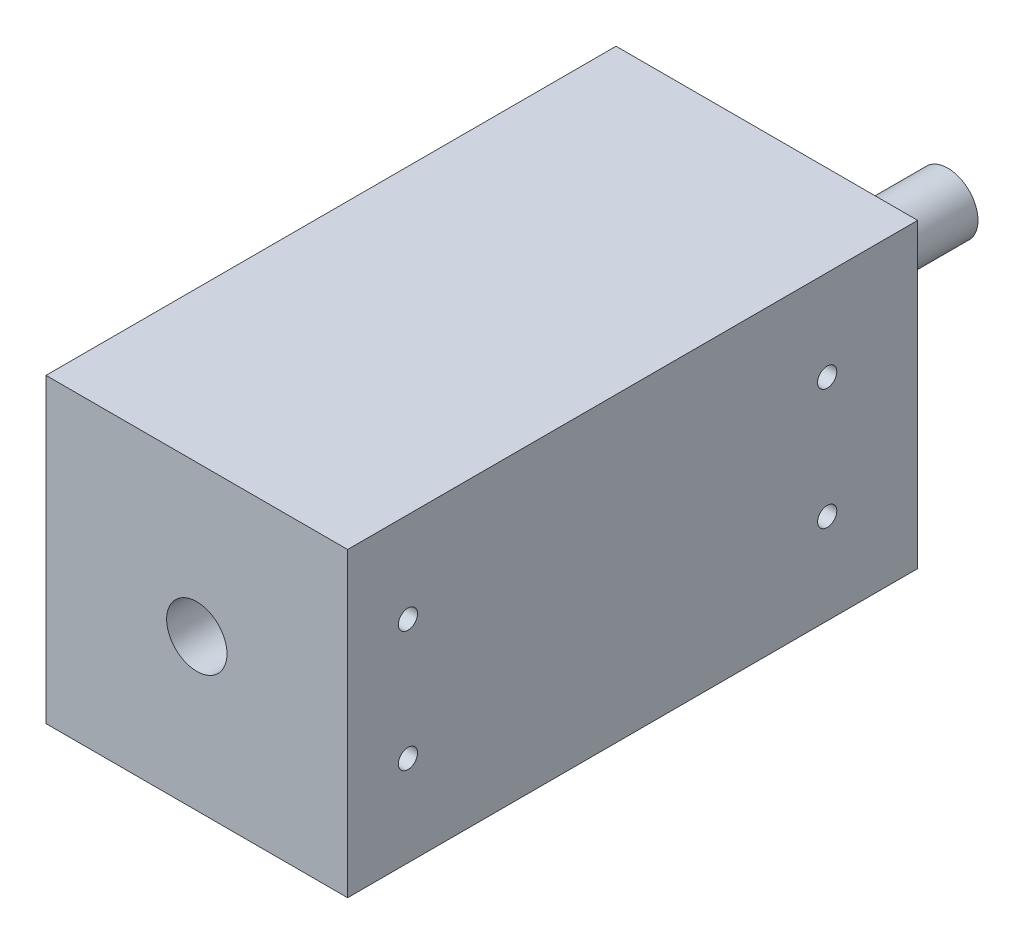
ISO-10303-21;
HEADER;
FILE_DESCRIPTION(('STEP AP214'),'2;1');
FILE_NAME('part.step','',(''),(''),'','','');
FILE_SCHEMA(('AUTOMOTIVE_DESIGN { 1 0 10303 214 1 1 1 1 }'));
ENDSEC;
DATA;
#1=APPLICATION_CONTEXT('core data for automotive mechanical design processes');
#2=APPLICATION_PROTOCOL_DEFINITION('international standard','automotive_design',2000,#1);
#3=PRODUCT_CONTEXT('',#1,'mechanical');
#4=PRODUCT('Part','Part','',(#3));
#5=PRODUCT_RELATED_PRODUCT_CATEGORY('part','',(#4));
#6=PRODUCT_DEFINITION_FORMATION('','',#4);
#7=PRODUCT_DEFINITION_CONTEXT('part definition',#1,'design');
#8=PRODUCT_DEFINITION('design','',#6,#7);
#9=PRODUCT_DEFINITION_SHAPE('','',#8);
#10=(LENGTH_UNIT() NAMED_UNIT(*) SI_UNIT(.MILLI.,.METRE.));
#11=(NAMED_UNIT(*) PLANE_ANGLE_UNIT() SI_UNIT($,.RADIAN.));
#12=(NAMED_UNIT(*) SI_UNIT($,.STERADIAN.) SOLID_ANGLE_UNIT());
#13=UNCERTAINTY_MEASURE_WITH_UNIT(LENGTH_MEASURE(1.E-05),#10,'distance_accuracy_value','');
#14=(GEOMETRIC_REPRESENTATION_CONTEXT(3) GLOBAL_UNCERTAINTY_ASSIGNED_CONTEXT((#13)) GLOBAL_UNIT_ASSIGNED_CONTEXT((#10,
#11,#12)) REPRESENTATION_CONTEXT('',''));
#15=CARTESIAN_POINT('',(0.,0.,0.));
#16=DIRECTION('',(0.,0.,1.));
#17=DIRECTION('',(1.,0.,0.));
#18=AXIS2_PLACEMENT_3D('',#15,#16,#17);
#19=CARTESIAN_POINT('',(31.75,31.75,60.0075));
#20=DIRECTION('',(-1.,0.,0.));
#21=DIRECTION('',(0.,-1.,0.));
#22=AXIS2_PLACEMENT_3D('',#19,#20,#21);
#23=PLANE('',#22);
#24=CARTESIAN_POINT('',(31.75,12.7,-40.9575));
#25=DIRECTION('',(-1.,0.,0.));
#26=DIRECTION('',(0.,0.,1.));
#27=AXIS2_PLACEMENT_3D('',#24,#25,#26);
#28=CIRCLE('',#27,2.01929999999999);
#29=CARTESIAN_POINT('',(31.75,12.7,-38.9382));
#30=VERTEX_POINT('',#29);
#31=EDGE_CURVE('E139',#30,#30,#28,.T.);
#32=ORIENTED_EDGE('',*,*,#31,.T.);
#33=EDGE_LOOP('',(#32));
#34=FACE_BOUND('',#33,.T.);
#35=CARTESIAN_POINT('',(31.75,-12.7,-40.9575));
#36=DIRECTION('',(-1.,0.,0.));
#37=DIRECTION('',(0.,0.,1.));
#38=AXIS2_PLACEMENT_3D('',#35,#36,#37);
#39=CIRCLE('',#38,2.01929999999999);
#40=CARTESIAN_POINT('',(31.75,-12.7,-38.9382));
#41=VERTEX_POINT('',#40);
#42=EDGE_CURVE('E143',#41,#41,#39,.T.);
#43=ORIENTED_EDGE('',*,*,#42,.T.);
#44=EDGE_LOOP('',(#43));
#45=FACE_BOUND('',#44,.T.);
#46=CARTESIAN_POINT('',(31.75,-12.7,47.3075));
#47=DIRECTION('',(-1.,0.,0.));
#48=DIRECTION('',(0.,0.,1.));
#49=AXIS2_PLACEMENT_3D('',#46,#47,#48);
#50=CIRCLE('',#49,2.01929999999999);
#51=CARTESIAN_POINT('',(31.75,-12.7,49.3268));
#52=VERTEX_POINT('',#51);
#53=EDGE_CURVE('E147',#52,#52,#50,.T.);
#54=ORIENTED_EDGE('',*,*,#53,.T.);
#55=EDGE_LOOP('',(#54));
#56=FACE_BOUND('',#55,.T.);
#57=CARTESIAN_POINT('',(31.75,12.7,47.3075));
#58=DIRECTION('',(-1.,0.,0.));
#59=DIRECTION('',(0.,0.,1.));
#60=AXIS2_PLACEMENT_3D('',#57,#58,#59);
#61=CIRCLE('',#60,2.01929999999999);
#62=CARTESIAN_POINT('',(31.75,12.7,49.3268));
#63=VERTEX_POINT('',#62);
#64=EDGE_CURVE('E150',#63,#63,#61,.T.);
#65=ORIENTED_EDGE('',*,*,#64,.T.);
#66=EDGE_LOOP('',(#65));
#67=FACE_BOUND('',#66,.T.);
#68=DIRECTION('',(0.,1.,0.));
#69=VECTOR('',#68,1.);
#70=CARTESIAN_POINT('',(31.75,31.75,-60.0075));
#71=LINE('',#70,#69);
#72=CARTESIAN_POINT('',(31.75,-31.75,-60.0075));
#73=VERTEX_POINT('',#72);
#74=CARTESIAN_POINT('',(31.75,31.75,-60.0075));
#75=VERTEX_POINT('',#74);
#76=EDGE_CURVE('E101',#73,#75,#71,.T.);
#77=ORIENTED_EDGE('',*,*,#76,.T.);
#78=DIRECTION('',(0.,0.,-1.));
#79=VECTOR('',#78,1.);
#80=CARTESIAN_POINT('',(31.75,31.75,60.0075));
#81=LINE('',#80,#79);
#82=CARTESIAN_POINT('',(31.75,31.75,60.0075));
#83=VERTEX_POINT('',#82);
#84=EDGE_CURVE('E43',#83,#75,#81,.T.);
#85=ORIENTED_EDGE('',*,*,#84,.F.);
#86=DIRECTION('',(0.,1.,0.));
#87=VECTOR('',#86,1.);
#88=CARTESIAN_POINT('',(31.75,31.75,60.0075));
#89=LINE('',#88,#87);
#90=CARTESIAN_POINT('',(31.75,-31.75,60.0075));
#91=VERTEX_POINT('',#90);
#92=EDGE_CURVE('E87',#91,#83,#89,.T.);
#93=ORIENTED_EDGE('',*,*,#92,.F.);
#94=DIRECTION('',(0.,0.,-1.));
#95=VECTOR('',#94,1.);
#96=CARTESIAN_POINT('',(31.75,-31.75,60.0075));
#97=LINE('',#96,#95);
#98=EDGE_CURVE('E97',#91,#73,#97,.T.);
#99=ORIENTED_EDGE('',*,*,#98,.T.);
#100=EDGE_LOOP('',(#77,#85,#93,#99));
#101=FACE_BOUND('',#100,.T.);
#102=ADVANCED_FACE('F35',(#34,#45,#56,#67,#101),#23,.F.);
#103=CARTESIAN_POINT('',(-31.75,31.75,60.0075));
#104=DIRECTION('',(0.,-1.,0.));
#105=DIRECTION('',(0.,0.,-1.));
#106=AXIS2_PLACEMENT_3D('',#103,#104,#105);
#107=PLANE('',#106);
#108=DIRECTION('',(-1.,0.,0.));
#109=VECTOR('',#108,1.);
#110=CARTESIAN_POINT('',(-31.75,31.75,-60.0075));
#111=LINE('',#110,#109);
#112=CARTESIAN_POINT('',(-31.75,31.75,-60.0075));
#113=VERTEX_POINT('',#112);
#114=EDGE_CURVE('E92',#75,#113,#111,.T.);
#115=ORIENTED_EDGE('',*,*,#114,.T.);
#116=DIRECTION('',(0.,0.,-1.));
#117=VECTOR('',#116,1.);
#118=CARTESIAN_POINT('',(-31.75,31.75,60.0075));
#119=LINE('',#118,#117);
#120=CARTESIAN_POINT('',(-31.75,31.75,60.0075));
#121=VERTEX_POINT('',#120);
#122=EDGE_CURVE('E90',#121,#113,#119,.T.);
#123=ORIENTED_EDGE('',*,*,#122,.F.);
#124=DIRECTION('',(-1.,0.,0.));
#125=VECTOR('',#124,1.);
#126=CARTESIAN_POINT('',(-31.75,31.75,60.0075));
#127=LINE('',#126,#125);
#128=EDGE_CURVE('E82',#83,#121,#127,.T.);
#129=ORIENTED_EDGE('',*,*,#128,.F.);
#130=ORIENTED_EDGE('',*,*,#84,.T.);
#131=EDGE_LOOP('',(#115,#123,#129,#130));
#132=FACE_BOUND('',#131,.T.);
#133=ADVANCED_FACE('F91',(#132),#107,.F.);
#134=CARTESIAN_POINT('',(-31.75,31.75,60.0075));
#135=DIRECTION('',(1.,0.,0.));
#136=DIRECTION('',(0.,1.,0.));
#137=AXIS2_PLACEMENT_3D('',#134,#135,#136);
#138=PLANE('',#137);
#139=CARTESIAN_POINT('',(-31.75,12.7,-40.9575));
#140=DIRECTION('',(-1.,0.,0.));
#141=DIRECTION('',(0.,0.,1.));
#142=AXIS2_PLACEMENT_3D('',#139,#140,#141);
#143=CIRCLE('',#142,2.0193);
#144=CARTESIAN_POINT('',(-31.75,12.7,-38.9382));
#145=VERTEX_POINT('',#144);
#146=EDGE_CURVE('E200',#145,#145,#143,.T.);
#147=ORIENTED_EDGE('',*,*,#146,.F.);
#148=EDGE_LOOP('',(#147));
#149=FACE_BOUND('',#148,.T.);
#150=CARTESIAN_POINT('',(-31.75,-12.7,-40.9575));
#151=DIRECTION('',(-1.,0.,0.));
#152=DIRECTION('',(0.,0.,1.));
#153=AXIS2_PLACEMENT_3D('',#150,#151,#152);
#154=CIRCLE('',#153,2.0193);
#155=CARTESIAN_POINT('',(-31.75,-12.7,-38.9382));
#156=VERTEX_POINT('',#155);
#157=EDGE_CURVE('E203',#156,#156,#154,.T.);
#158=ORIENTED_EDGE('',*,*,#157,.F.);
#159=EDGE_LOOP('',(#158));
#160=FACE_BOUND('',#159,.T.);
#161=CARTESIAN_POINT('',(-31.75,-12.7,47.3075));
#162=DIRECTION('',(-1.,0.,0.));
#163=DIRECTION('',(0.,0.,1.));
#164=AXIS2_PLACEMENT_3D('',#161,#162,#163);
#165=CIRCLE('',#164,2.0193);
#166=CARTESIAN_POINT('',(-31.75,-12.7,49.3268));
#167=VERTEX_POINT('',#166);
#168=EDGE_CURVE('E209',#167,#167,#165,.T.);
#169=ORIENTED_EDGE('',*,*,#168,.F.);
#170=EDGE_LOOP('',(#169));
#171=FACE_BOUND('',#170,.T.);
#172=CARTESIAN_POINT('',(-31.75,12.7,47.3075));
#173=DIRECTION('',(-1.,0.,0.));
#174=DIRECTION('',(0.,0.,1.));
#175=AXIS2_PLACEMENT_3D('',#172,#173,#174);
#176=CIRCLE('',#175,2.0193);
#177=CARTESIAN_POINT('',(-31.75,12.7,49.3268));
#178=VERTEX_POINT('',#177);
#179=EDGE_CURVE('E153',#178,#178,#176,.T.);
#180=ORIENTED_EDGE('',*,*,#179,.F.);
#181=EDGE_LOOP('',(#180));
#182=FACE_BOUND('',#181,.T.);
#183=DIRECTION('',(0.,-1.,0.));
#184=VECTOR('',#183,1.);
#185=CARTESIAN_POINT('',(-31.75,31.75,-60.0075));
#186=LINE('',#185,#184);
#187=CARTESIAN_POINT('',(-31.75,-31.75,-60.0075));
#188=VERTEX_POINT('',#187);
#189=EDGE_CURVE('E68',#113,#188,#186,.T.);
#190=ORIENTED_EDGE('',*,*,#189,.T.);
#191=DIRECTION('',(0.,0.,-1.));
#192=VECTOR('',#191,1.);
#193=CARTESIAN_POINT('',(-31.75,-31.75,60.0075));
#194=LINE('',#193,#192);
#195=CARTESIAN_POINT('',(-31.75,-31.75,60.0075));
#196=VERTEX_POINT('',#195);
#197=EDGE_CURVE('E93',#196,#188,#194,.T.);
#198=ORIENTED_EDGE('',*,*,#197,.F.);
#199=DIRECTION('',(0.,-1.,0.));
#200=VECTOR('',#199,1.);
#201=CARTESIAN_POINT('',(-31.75,31.75,60.0075));
#202=LINE('',#201,#200);
#203=EDGE_CURVE('E85',#121,#196,#202,.T.);
#204=ORIENTED_EDGE('',*,*,#203,.F.);
#205=ORIENTED_EDGE('',*,*,#122,.T.);
#206=EDGE_LOOP('',(#190,#198,#204,#205));
#207=FACE_BOUND('',#206,.T.);
#208=ADVANCED_FACE('F95',(#149,#160,#171,#182,#207),#138,.F.);
#209=CARTESIAN_POINT('',(-31.75,-31.75,60.0075));
#210=DIRECTION('',(0.,1.,0.));
#211=DIRECTION('',(0.,0.,1.));
#212=AXIS2_PLACEMENT_3D('',#209,#210,#211);
#213=PLANE('',#212);
#214=DIRECTION('',(1.,0.,0.));
#215=VECTOR('',#214,1.);
#216=CARTESIAN_POINT('',(-31.75,-31.75,-60.0075));
#217=LINE('',#216,#215);
#218=EDGE_CURVE('E74',#188,#73,#217,.T.);
#219=ORIENTED_EDGE('',*,*,#218,.T.);
#220=ORIENTED_EDGE('',*,*,#98,.F.);
#221=DIRECTION('',(1.,0.,0.));
#222=VECTOR('',#221,1.);
#223=CARTESIAN_POINT('',(-31.75,-31.75,60.0075));
#224=LINE('',#223,#222);
#225=EDGE_CURVE('E51',#196,#91,#224,.T.);
#226=ORIENTED_EDGE('',*,*,#225,.F.);
#227=ORIENTED_EDGE('',*,*,#197,.T.);
#228=EDGE_LOOP('',(#219,#220,#226,#227));
#229=FACE_BOUND('',#228,.T.);
#230=ADVANCED_FACE('F124',(#229),#213,.F.);
#231=CARTESIAN_POINT('',(0.,0.,60.0075));
#232=DIRECTION('',(0.,0.,1.));
#233=DIRECTION('',(1.,0.,0.));
#234=AXIS2_PLACEMENT_3D('',#231,#232,#233);
#235=PLANE('',#234);
#236=CARTESIAN_POINT('',(0.,0.,60.0075));
#237=DIRECTION('',(0.,0.,1.));
#238=DIRECTION('',(1.,0.,0.));
#239=AXIS2_PLACEMENT_3D('',#236,#237,#238);
#240=CIRCLE('',#239,6.35);
#241=CARTESIAN_POINT('',(6.35,0.,60.0075));
#242=VERTEX_POINT('',#241);
#243=EDGE_CURVE('E152',#242,#242,#240,.T.);
#244=ORIENTED_EDGE('',*,*,#243,.F.);
#245=EDGE_LOOP('',(#244));
#246=FACE_BOUND('',#245,.T.);
#247=ORIENTED_EDGE('',*,*,#92,.T.);
#248=ORIENTED_EDGE('',*,*,#128,.T.);
#249=ORIENTED_EDGE('',*,*,#203,.T.);
#250=ORIENTED_EDGE('',*,*,#225,.T.);
#251=EDGE_LOOP('',(#247,#248,#249,#250));
#252=FACE_BOUND('',#251,.T.);
#253=ADVANCED_FACE('F83',(#246,#252),#235,.T.);
#254=CARTESIAN_POINT('',(0.,0.,-60.0075));
#255=DIRECTION('',(0.,0.,1.));
#256=DIRECTION('',(1.,0.,0.));
#257=AXIS2_PLACEMENT_3D('',#254,#255,#256);
#258=PLANE('',#257);
#259=CARTESIAN_POINT('',(0.,0.,-60.0075));
#260=DIRECTION('',(0.,0.,1.));
#261=DIRECTION('',(1.,0.,0.));
#262=AXIS2_PLACEMENT_3D('',#259,#260,#261);
#263=CIRCLE('',#262,6.35);
#264=CARTESIAN_POINT('',(6.35,0.,-60.0075));
#265=VERTEX_POINT('',#264);
#266=EDGE_CURVE('E11',#265,#265,#263,.F.);
#267=ORIENTED_EDGE('',*,*,#266,.F.);
#268=EDGE_LOOP('',(#267));
#269=FACE_BOUND('',#268,.T.);
#270=ORIENTED_EDGE('',*,*,#76,.F.);
#271=ORIENTED_EDGE('',*,*,#218,.F.);
#272=ORIENTED_EDGE('',*,*,#189,.F.);
#273=ORIENTED_EDGE('',*,*,#114,.F.);
#274=EDGE_LOOP('',(#270,#271,#272,#273));
#275=FACE_BOUND('',#274,.T.);
#276=ADVANCED_FACE('F112',(#269,#275),#258,.F.);
#277=CARTESIAN_POINT('',(0.,0.,-98.1075));
#278=DIRECTION('',(0.,0.,1.));
#279=DIRECTION('',(1.,0.,0.));
#280=AXIS2_PLACEMENT_3D('',#277,#278,#279);
#281=CYLINDRICAL_SURFACE('',#280,6.35);
#282=CARTESIAN_POINT('',(0.,0.,-98.1075));
#283=DIRECTION('',(0.,0.,-1.));
#284=DIRECTION('',(-1.,0.,0.));
#285=AXIS2_PLACEMENT_3D('',#282,#283,#284);
#286=CIRCLE('',#285,6.35);
#287=CARTESIAN_POINT('',(-6.35,0.,-98.1075));
#288=VERTEX_POINT('',#287);
#289=EDGE_CURVE('E104',#288,#288,#286,.T.);
#290=ORIENTED_EDGE('',*,*,#289,.F.);
#291=EDGE_LOOP('',(#290));
#292=FACE_BOUND('',#291,.T.);
#293=ORIENTED_EDGE('',*,*,#266,.T.);
#294=EDGE_LOOP('',(#293));
#295=FACE_BOUND('',#294,.T.);
#296=ADVANCED_FACE('F114',(#292,#295),#281,.T.);
#297=CARTESIAN_POINT('',(0.,0.,-98.1075));
#298=DIRECTION('',(0.,0.,-1.));
#299=DIRECTION('',(-1.,0.,0.));
#300=AXIS2_PLACEMENT_3D('',#297,#298,#299);
#301=PLANE('',#300);
#302=ORIENTED_EDGE('',*,*,#289,.T.);
#303=EDGE_LOOP('',(#302));
#304=FACE_BOUND('',#303,.T.);
#305=ADVANCED_FACE('F121',(#304),#301,.T.);
#306=CARTESIAN_POINT('',(0.,0.,21.9075));
#307=DIRECTION('',(0.,0.,1.));
#308=DIRECTION('',(1.,0.,0.));
#309=AXIS2_PLACEMENT_3D('',#306,#307,#308);
#310=CYLINDRICAL_SURFACE('',#309,6.35);
#311=CARTESIAN_POINT('',(0.,0.,21.9075));
#312=DIRECTION('',(0.,0.,1.));
#313=DIRECTION('',(1.,0.,0.));
#314=AXIS2_PLACEMENT_3D('',#311,#312,#313);
#315=CIRCLE('',#314,6.35);
#316=CARTESIAN_POINT('',(6.35,0.,21.9075));
#317=VERTEX_POINT('',#316);
#318=EDGE_CURVE('E156',#317,#317,#315,.T.);
#319=ORIENTED_EDGE('',*,*,#318,.F.);
#320=EDGE_LOOP('',(#319));
#321=FACE_BOUND('',#320,.T.);
#322=ORIENTED_EDGE('',*,*,#243,.T.);
#323=EDGE_LOOP('',(#322));
#324=FACE_BOUND('',#323,.T.);
#325=ADVANCED_FACE('F169',(#321,#324),#310,.F.);
#326=CARTESIAN_POINT('',(0.,0.,21.9075));
#327=DIRECTION('',(0.,0.,1.));
#328=DIRECTION('',(1.,0.,0.));
#329=AXIS2_PLACEMENT_3D('',#326,#327,#328);
#330=PLANE('',#329);
#331=ORIENTED_EDGE('',*,*,#318,.T.);
#332=EDGE_LOOP('',(#331));
#333=FACE_BOUND('',#332,.T.);
#334=ADVANCED_FACE('F174',(#333),#330,.T.);
#335=CARTESIAN_POINT('',(-31.75,12.7,47.3075));
#336=DIRECTION('',(-1.,0.,0.));
#337=DIRECTION('',(0.,0.,1.));
#338=AXIS2_PLACEMENT_3D('',#335,#336,#337);
#339=CYLINDRICAL_SURFACE('',#338,2.0193);
#340=ORIENTED_EDGE('',*,*,#64,.F.);
#341=EDGE_LOOP('',(#340));
#342=FACE_BOUND('',#341,.T.);
#343=ORIENTED_EDGE('',*,*,#179,.T.);
#344=EDGE_LOOP('',(#343));
#345=FACE_BOUND('',#344,.T.);
#346=ADVANCED_FACE('F180',(#342,#345),#339,.F.);
#347=CARTESIAN_POINT('',(-31.75,-12.7,47.3075));
#348=DIRECTION('',(-1.,0.,0.));
#349=DIRECTION('',(0.,0.,1.));
#350=AXIS2_PLACEMENT_3D('',#347,#348,#349);
#351=CYLINDRICAL_SURFACE('',#350,2.0193);
#352=ORIENTED_EDGE('',*,*,#53,.F.);
#353=EDGE_LOOP('',(#352));
#354=FACE_BOUND('',#353,.T.);
#355=ORIENTED_EDGE('',*,*,#168,.T.);
#356=EDGE_LOOP('',(#355));
#357=FACE_BOUND('',#356,.T.);
#358=ADVANCED_FACE('F184',(#354,#357),#351,.F.);
#359=CARTESIAN_POINT('',(-31.75,-12.7,-40.9575));
#360=DIRECTION('',(-1.,0.,0.));
#361=DIRECTION('',(0.,0.,1.));
#362=AXIS2_PLACEMENT_3D('',#359,#360,#361);
#363=CYLINDRICAL_SURFACE('',#362,2.0193);
#364=ORIENTED_EDGE('',*,*,#42,.F.);
#365=EDGE_LOOP('',(#364));
#366=FACE_BOUND('',#365,.T.);
#367=ORIENTED_EDGE('',*,*,#157,.T.);
#368=EDGE_LOOP('',(#367));
#369=FACE_BOUND('',#368,.T.);
#370=ADVANCED_FACE('F187',(#366,#369),#363,.F.);
#371=CARTESIAN_POINT('',(-31.75,12.7,-40.9575));
#372=DIRECTION('',(-1.,0.,0.));
#373=DIRECTION('',(0.,0.,1.));
#374=AXIS2_PLACEMENT_3D('',#371,#372,#373);
#375=CYLINDRICAL_SURFACE('',#374,2.0193);
#376=ORIENTED_EDGE('',*,*,#31,.F.);
#377=EDGE_LOOP('',(#376));
#378=FACE_BOUND('',#377,.T.);
#379=ORIENTED_EDGE('',*,*,#146,.T.);
#380=EDGE_LOOP('',(#379));
#381=FACE_BOUND('',#380,.T.);
#382=ADVANCED_FACE('F191',(#378,#381),#375,.F.);
#383=CLOSED_SHELL('',(#102,#133,#208,#230,#253,#276,#296,#305,#325,#334,#346,#358,#370,#382));
#384=MANIFOLD_SOLID_BREP('B2',#383);
#385=ADVANCED_BREP_SHAPE_REPRESENTATION('',(#18,#384),#14);
#386=SHAPE_DEFINITION_REPRESENTATION(#9,#385);
ENDSEC;
END-ISO-10303-21;
